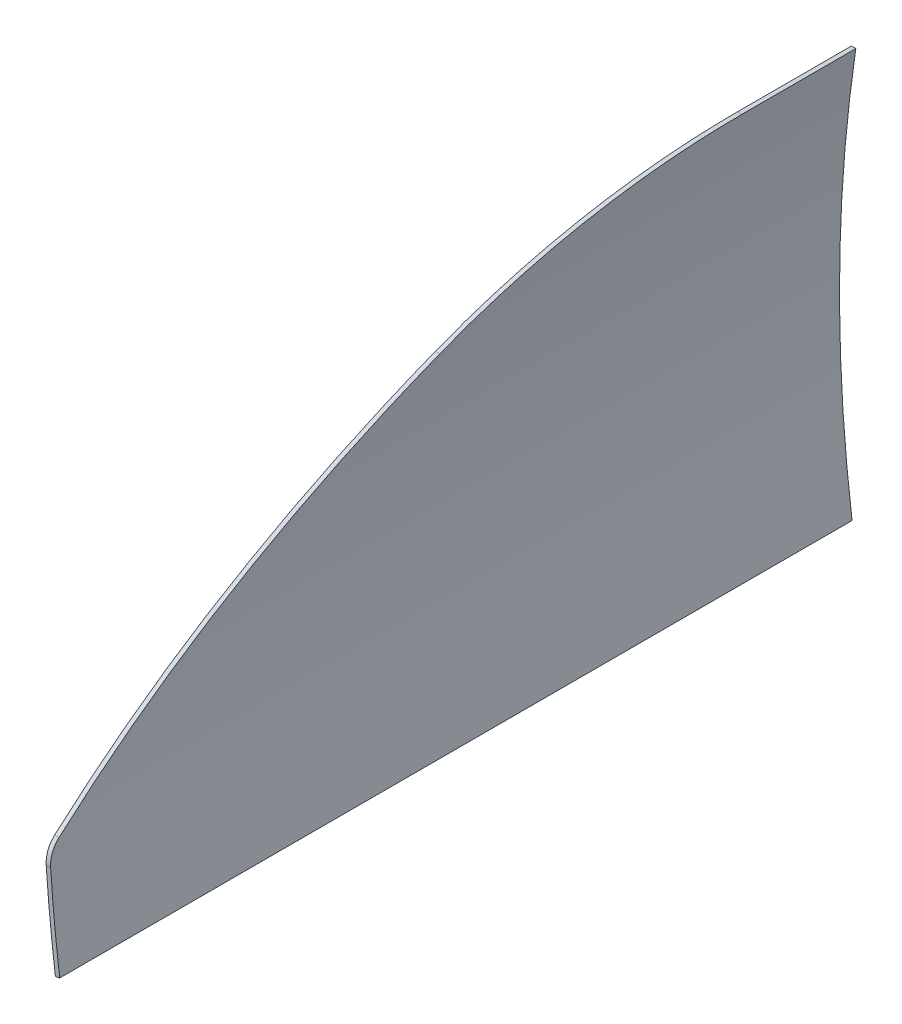
ISO-10303-21;
HEADER;
FILE_DESCRIPTION(('STEP AP214'),'2;1');
FILE_NAME('part.step','',(''),(''),'','','');
FILE_SCHEMA(('AUTOMOTIVE_DESIGN { 1 0 10303 214 1 1 1 1 }'));
ENDSEC;
DATA;
#1=APPLICATION_CONTEXT('core data for automotive mechanical design processes');
#2=APPLICATION_PROTOCOL_DEFINITION('international standard','automotive_design',2000,#1);
#3=PRODUCT_CONTEXT('',#1,'mechanical');
#4=PRODUCT('Part','Part','',(#3));
#5=PRODUCT_RELATED_PRODUCT_CATEGORY('part','',(#4));
#6=PRODUCT_DEFINITION_FORMATION('','',#4);
#7=PRODUCT_DEFINITION_CONTEXT('part definition',#1,'design');
#8=PRODUCT_DEFINITION('design','',#6,#7);
#9=PRODUCT_DEFINITION_SHAPE('','',#8);
#10=(LENGTH_UNIT() NAMED_UNIT(*) SI_UNIT(.MILLI.,.METRE.));
#11=(NAMED_UNIT(*) PLANE_ANGLE_UNIT() SI_UNIT($,.RADIAN.));
#12=(NAMED_UNIT(*) SI_UNIT($,.STERADIAN.) SOLID_ANGLE_UNIT());
#13=UNCERTAINTY_MEASURE_WITH_UNIT(LENGTH_MEASURE(1.E-05),#10,'distance_accuracy_value','');
#14=(GEOMETRIC_REPRESENTATION_CONTEXT(3) GLOBAL_UNCERTAINTY_ASSIGNED_CONTEXT((#13)) GLOBAL_UNIT_ASSIGNED_CONTEXT((#10,
#11,#12)) REPRESENTATION_CONTEXT('',''));
#15=CARTESIAN_POINT('',(0.,0.,0.));
#16=DIRECTION('',(0.,0.,1.));
#17=DIRECTION('',(1.,0.,0.));
#18=AXIS2_PLACEMENT_3D('',#15,#16,#17);
#19=CARTESIAN_POINT('',(1662.91267359414,250.,500.));
#20=DIRECTION('',(0.,0.,-1.));
#21=DIRECTION('',(-1.,0.,0.));
#22=AXIS2_PLACEMENT_3D('',#19,#20,#21);
#23=CYLINDRICAL_SURFACE('',#22,1679.1);
#24=CARTESIAN_POINT('',(1662.91267359414,250.,404.));
#25=DIRECTION('',(0.,0.,1.));
#26=DIRECTION('',(1.,0.,0.));
#27=AXIS2_PLACEMENT_3D('',#24,#25,#26);
#28=CIRCLE('',#27,1679.1);
#29=CARTESIAN_POINT('',(-1.85821629717053,31.1057466023691,404.));
#30=VERTEX_POINT('',#29);
#31=CARTESIAN_POINT('',(-12.2574940213667,135.188330161751,404.));
#32=VERTEX_POINT('',#31);
#33=EDGE_CURVE('E74',#30,#32,#28,.F.);
#34=ORIENTED_EDGE('',*,*,#33,.F.);
#35=DIRECTION('',(0.,0.,1.));
#36=VECTOR('',#35,1.);
#37=CARTESIAN_POINT('',(-1.85821629717053,31.1057466023691,-500.));
#38=LINE('',#37,#36);
#39=CARTESIAN_POINT('',(-1.85821629717053,31.1057466023691,-500.));
#40=VERTEX_POINT('',#39);
#41=EDGE_CURVE('E115',#40,#30,#38,.T.);
#42=ORIENTED_EDGE('',*,*,#41,.F.);
#43=CARTESIAN_POINT('',(1662.91267359414,250.,-500.));
#44=DIRECTION('',(0.,0.,1.));
#45=DIRECTION('',(1.,0.,0.));
#46=AXIS2_PLACEMENT_3D('',#43,#44,#45);
#47=CIRCLE('',#46,1679.1);
#48=CARTESIAN_POINT('',(2.4722179376695,499.628330161751,-500.));
#49=VERTEX_POINT('',#48);
#50=EDGE_CURVE('E66',#40,#49,#47,.F.);
#51=ORIENTED_EDGE('',*,*,#50,.T.);
#52=DIRECTION('',(0.,0.,1.));
#53=VECTOR('',#52,1.);
#54=CARTESIAN_POINT('',(2.4722179376695,499.628330161751,500.));
#55=LINE('',#54,#53);
#56=CARTESIAN_POINT('',(2.4722179376695,499.628330161751,-370.));
#57=VERTEX_POINT('',#56);
#58=EDGE_CURVE('E208',#49,#57,#55,.T.);
#59=ORIENTED_EDGE('',*,*,#58,.T.);
#60=CARTESIAN_POINT('',(-6.9458065284167,425.92460419963,-34.5991617203481));
#61=CARTESIAN_POINT('',(-6.69665422505623,428.289455799148,-39.7201293279682));
#62=CARTESIAN_POINT('',(-6.44814509912683,430.600140181221,-44.8661296534168));
#63=CARTESIAN_POINT('',(-5.95383995624069,435.112203418949,-55.2059611368377));
#64=CARTESIAN_POINT('',(-5.70804394052839,437.313582224469,-60.3997923167466));
#65=CARTESIAN_POINT('',(-5.22058710120033,441.606104214611,-70.8331511283629));
#66=CARTESIAN_POINT('',(-4.97892636085668,443.697245181133,-76.0726796770793));
#67=CARTESIAN_POINT('',(-4.5011069586019,447.768281725359,-86.5949217074381));
#68=CARTESIAN_POINT('',(-4.26494829526287,449.748177331933,-91.8776351778729));
#69=CARTESIAN_POINT('',(-3.56643098544166,455.521918043394,-107.793379311696));
#70=CARTESIAN_POINT('',(-3.11429256666275,459.147536755344,-118.488471315989));
#71=CARTESIAN_POINT('',(-2.24712198400071,465.943039964759,-140.023356894242));
#72=CARTESIAN_POINT('',(-1.83208912227906,469.112933033668,-150.863147742464));
#73=CARTESIAN_POINT('',(-1.0548726973034,474.938422892343,-172.47225093206));
#74=CARTESIAN_POINT('',(-0.691871298106507,477.602260730111,-183.239311186875));
#75=CARTESIAN_POINT('',(-0.0171953739844435,482.480376850164,-204.876803532081));
#76=CARTESIAN_POINT('',(0.294477429150202,484.694640052288,-215.74723907721));
#77=CARTESIAN_POINT('',(0.860236924533955,488.668247349398,-237.565499413399));
#78=CARTESIAN_POINT('',(1.11435833954759,490.427865838209,-248.513273409471));
#79=CARTESIAN_POINT('',(1.56034320955563,493.490542973513,-270.472829099929));
#80=CARTESIAN_POINT('',(1.75221486004451,494.793661722294,-281.484602174044));
#81=CARTESIAN_POINT('',(1.95738850827555,496.179701213508,-295.728081119642));
#82=CARTESIAN_POINT('',(2.00083869214886,496.472639202832,-298.939820124848));
#83=CARTESIAN_POINT('',(2.08210450724497,497.019652066328,-305.366580087286));
#84=CARTESIAN_POINT('',(2.11992035367996,497.273728424889,-308.581600914437));
#85=CARTESIAN_POINT('',(2.22481135626323,497.977538930866,-318.230025533762));
#86=CARTESIAN_POINT('',(2.2833455097172,498.368959189604,-324.667867252615));
#87=CARTESIAN_POINT('',(2.37749551935759,498.997669252438,-337.585551031748));
#88=CARTESIAN_POINT('',(2.41298766087124,499.234127112253,-344.065434177928));
#89=CARTESIAN_POINT('',(2.46036435475485,499.549479026968,-357.030200862375));
#90=CARTESIAN_POINT('',(2.47224496859774,499.628346795023,-363.515085054397));
#91=CARTESIAN_POINT('',(2.4722179376695,499.628330161751,-370.));
#92=B_SPLINE_CURVE_WITH_KNOTS('',3,(#60,#61,#62,#63,#64,#65,#66,#67,#68,#69,#70,#71,#72,#73,#74,
#75,#76,#77,#78,#79,#80,#81,#82,#83,#84,#85,#86,#87,#88,#89,#90,#91),.UNSPECIFIED.,.F.,.F.,(4,2,
2,2,2,2,2,2,2,2,2,2,2,2,2,4),(0.,16.9380846326702,33.8761770340212,50.8146101176378,
67.7530388053932,101.647878235621,135.542080076646,168.82527471867,202.109585600496,
235.373761075662,268.63355537605,278.309500796286,287.985076534121,307.332985956469,
326.783935297484,346.238128886989),.UNSPECIFIED.);
#93=CARTESIAN_POINT('',(-6.9458065284167,425.92460419963,-34.5991617203481));
#94=VERTEX_POINT('',#93);
#95=EDGE_CURVE('E199',#94,#57,#92,.T.);
#96=ORIENTED_EDGE('',*,*,#95,.F.);
#97=CARTESIAN_POINT('',(-13.6875775153225,158.411747589012,392.991389706895));
#98=CARTESIAN_POINT('',(-14.0526604980433,165.095014728516,384.818851780009));
#99=CARTESIAN_POINT('',(-14.3741894513233,171.714468700817,376.592252404173));
#100=CARTESIAN_POINT('',(-14.9347228152785,184.82354667566,360.033583620257));
#101=CARTESIAN_POINT('',(-15.1737279246748,191.313171777011,351.701515105794));
#102=CARTESIAN_POINT('',(-15.5737914896637,204.160127369066,334.934910867642));
#103=CARTESIAN_POINT('',(-15.7348544857563,210.51746554546,326.500381142157));
#104=CARTESIAN_POINT('',(-15.9835965028871,223.098173918881,309.531048813833));
#105=CARTESIAN_POINT('',(-16.0712753699186,229.321543834731,300.996246000595));
#106=CARTESIAN_POINT('',(-16.2305403339362,247.734216196206,275.319992747535));
#107=CARTESIAN_POINT('',(-16.2000296183187,259.722524737032,258.033022289067));
#108=CARTESIAN_POINT('',(-15.9009872164411,283.146739309586,223.091173373515));
#109=CARTESIAN_POINT('',(-15.6324524413265,294.582638170626,205.436290144906));
#110=CARTESIAN_POINT('',(-14.8915988909184,316.889129816982,169.7791494636));
#111=CARTESIAN_POINT('',(-14.4192959396728,327.759766425494,151.776919088559));
#112=CARTESIAN_POINT('',(-13.3041349428485,348.925923713831,115.442257232489));
#113=CARTESIAN_POINT('',(-12.6612763550171,359.221442565041,97.1098247018112));
#114=CARTESIAN_POINT('',(-11.5916576630007,374.247366502559,69.3379216376989));
#115=CARTESIAN_POINT('',(-11.2166229949857,379.196852325935,60.0143072319904));
#116=CARTESIAN_POINT('',(-10.4355944865959,388.947127714602,41.2908091601246));
#117=CARTESIAN_POINT('',(-10.02960061899,393.747917149098,31.8909254268886));
#118=CARTESIAN_POINT('',(-9.19056339639171,403.199499034462,13.0175340798333));
#119=CARTESIAN_POINT('',(-8.7575206256569,407.850294721914,3.54402806012586));
#120=CARTESIAN_POINT('',(-7.86816742590298,417.000928185204,-15.474496926653));
#121=CARTESIAN_POINT('',(-7.4118570623023,421.500766385411,-25.0195156925972));
#122=CARTESIAN_POINT('',(-6.94580652841649,425.92460419963,-34.5991617203481));
#123=B_SPLINE_CURVE_WITH_KNOTS('',3,(#97,#98,#99,#100,#101,#102,#103,#104,#105,#106,#107,#108,
#109,#110,#111,#112,#113,#114,#115,#116,#117,#118,#119,#120,#121,#122),.UNSPECIFIED.,.F.,.F.,(4,
2,2,2,2,2,2,2,2,2,2,2,4),(0.,31.6903050230312,63.3803417208028,95.0685321004802,
126.756788982061,189.854971713458,252.953973286261,316.048075654653,379.142378622431,
410.828963890059,442.515577028968,474.201505972228,505.887345833241),.UNSPECIFIED.);
#124=CARTESIAN_POINT('',(-13.6875775153225,158.411747589012,392.991389706895));
#125=VERTEX_POINT('',#124);
#126=EDGE_CURVE('E177',#125,#94,#123,.T.);
#127=ORIENTED_EDGE('',*,*,#126,.F.);
#128=CARTESIAN_POINT('',(-12.2574940213667,135.188330161751,404.));
#129=CARTESIAN_POINT('',(-12.2864303509859,135.610524856966,404.000000461225));
#130=CARTESIAN_POINT('',(-12.3152033484983,136.032683792228,403.991086522892));
#131=CARTESIAN_POINT('',(-12.3723795026291,136.876264779503,403.955452294848));
#132=CARTESIAN_POINT('',(-12.4007826677193,137.297686848203,403.928732413751));
#133=CARTESIAN_POINT('',(-12.4853616680688,138.559685367766,403.821913287983));
#134=CARTESIAN_POINT('',(-12.5409203534523,139.398188875581,403.71515453871));
#135=CARTESIAN_POINT('',(-12.6499925060041,141.063056240984,403.431283643352));
#136=CARTESIAN_POINT('',(-12.7035066300835,141.88942394433,403.254194306229));
#137=CARTESIAN_POINT('',(-12.7820081314885,143.115428253876,402.936818231514));
#138=CARTESIAN_POINT('',(-12.8078810880648,143.521850268377,402.822398391185));
#139=CARTESIAN_POINT('',(-12.8590142278855,144.329644118176,402.576470713362));
#140=CARTESIAN_POINT('',(-12.8842742524691,144.731014633194,402.44495850625));
#141=CARTESIAN_POINT('',(-12.9591045688719,145.926800879809,402.024973246489));
#142=CARTESIAN_POINT('',(-13.0077016081075,146.712524044109,401.711146657477));
#143=CARTESIAN_POINT('',(-13.1020404921137,148.254802470497,401.018179450907));
#144=CARTESIAN_POINT('',(-13.1477823222455,149.011357583031,400.639038498518));
#145=CARTESIAN_POINT('',(-13.214080157634,150.119809342587,400.023633414351));
#146=CARTESIAN_POINT('',(-13.2357877410823,150.484795843403,399.810783643453));
#147=CARTESIAN_POINT('',(-13.278414448833,151.205381719959,399.369912307869));
#148=CARTESIAN_POINT('',(-13.2993337916973,151.560983689508,399.141894998031));
#149=CARTESIAN_POINT('',(-13.3608843173413,152.61282487253,398.43562509339));
#150=CARTESIAN_POINT('',(-13.4003237306304,153.294362851921,397.935008205251));
#151=CARTESIAN_POINT('',(-13.4615129469372,154.362325531576,397.07884015903));
#152=CARTESIAN_POINT('',(-13.4842945370347,154.762566032009,396.740361341184));
#153=CARTESIAN_POINT('',(-13.5285512291079,155.544809266365,396.042872146603));
#154=CARTESIAN_POINT('',(-13.5500264614183,155.926813818856,395.683863825042));
#155=CARTESIAN_POINT('',(-13.5916281455417,156.671145444289,394.946664158291));
#156=CARTESIAN_POINT('',(-13.6117559204717,157.033491752044,394.568492291312));
#157=CARTESIAN_POINT('',(-13.6506747354486,157.738016724901,393.793587158713));
#158=CARTESIAN_POINT('',(-13.6694654753302,158.080190858401,393.396849758054));
#159=CARTESIAN_POINT('',(-13.6875775153225,158.411747589012,392.991389706895));
#160=B_SPLINE_CURVE_WITH_KNOTS('',3,(#128,#129,#130,#131,#132,#133,#134,#135,#136,#137,#138,
#139,#140,#141,#142,#143,#144,#145,#146,#147,#148,#149,#150,#151,#152,#153,#154,#155,#156,#157,
#158,#159),.UNSPECIFIED.,.F.,.F.,(4,2,2,2,2,2,2,2,2,2,2,2,2,2,2,4),(0.,1.26936796567069,
2.53870680251005,5.07680077410025,7.61407228599208,8.88278287242372,10.1518184415712,
12.6910262003151,15.2302469765906,16.4991318934746,17.7676623476523,20.3038206508079,
21.8772282234229,23.4504785596797,25.0221606911959,26.5941945601457),.UNSPECIFIED.);
#161=EDGE_CURVE('E136',#32,#125,#160,.T.);
#162=ORIENTED_EDGE('',*,*,#161,.F.);
#163=EDGE_LOOP('',(#34,#42,#51,#59,#96,#127,#162));
#164=FACE_BOUND('',#163,.T.);
#165=ADVANCED_FACE('F48',(#164),#23,.F.);
#166=CARTESIAN_POINT('',(1662.91267359414,250.,500.));
#167=DIRECTION('',(0.,0.,-1.));
#168=DIRECTION('',(-1.,0.,0.));
#169=AXIS2_PLACEMENT_3D('',#166,#167,#168);
#170=CYLINDRICAL_SURFACE('',#169,1684.1);
#171=CARTESIAN_POINT('',(1662.91267359414,250.,-500.));
#172=DIRECTION('',(0.,0.,1.));
#173=DIRECTION('',(1.,0.,0.));
#174=AXIS2_PLACEMENT_3D('',#171,#172,#173);
#175=CIRCLE('',#174,1684.1);
#176=CARTESIAN_POINT('',(-6.7806035687441,30.1883301617507,-500.));
#177=VERTEX_POINT('',#176);
#178=CARTESIAN_POINT('',(-2.58380096852528,499.628330161751,-500.));
#179=VERTEX_POINT('',#178);
#180=EDGE_CURVE('E132',#177,#179,#175,.F.);
#181=ORIENTED_EDGE('',*,*,#180,.F.);
#182=DIRECTION('',(0.,0.,-1.));
#183=VECTOR('',#182,1.);
#184=CARTESIAN_POINT('',(-6.7806035687441,30.1883301617507,500.));
#185=LINE('',#184,#183);
#186=CARTESIAN_POINT('',(-6.7806035687441,30.1883301617507,404.));
#187=VERTEX_POINT('',#186);
#188=EDGE_CURVE('E117',#177,#187,#185,.F.);
#189=ORIENTED_EDGE('',*,*,#188,.T.);
#190=CARTESIAN_POINT('',(1662.91267359414,250.,404.));
#191=DIRECTION('',(0.,0.,1.));
#192=DIRECTION('',(1.,0.,0.));
#193=AXIS2_PLACEMENT_3D('',#190,#191,#192);
#194=CIRCLE('',#193,1684.1);
#195=CARTESIAN_POINT('',(-17.2691887258185,135.188330161751,404.));
#196=VERTEX_POINT('',#195);
#197=EDGE_CURVE('E12',#187,#196,#194,.F.);
#198=ORIENTED_EDGE('',*,*,#197,.T.);
#199=CARTESIAN_POINT('',(-17.2691887258185,135.188330161751,404.));
#200=CARTESIAN_POINT('',(-17.2980386030764,135.610522804638,404.000000461543));
#201=CARTESIAN_POINT('',(-17.326725636894,136.03267962108,403.991086609519));
#202=CARTESIAN_POINT('',(-17.3837309692695,136.876256231334,403.955452745514));
#203=CARTESIAN_POINT('',(-17.4120492762758,137.29767604184,403.928733142238));
#204=CARTESIAN_POINT('',(-17.4963755833221,138.559667528155,403.821915170074));
#205=CARTESIAN_POINT('',(-17.5517682778365,139.398166049207,403.715157616705));
#206=CARTESIAN_POINT('',(-17.6605145245861,141.063022378518,403.431290230891));
#207=CARTESIAN_POINT('',(-17.7138687330068,141.889384039979,403.254203250137));
#208=CARTESIAN_POINT('',(-17.7921356511594,143.115378964162,402.936831684554));
#209=CARTESIAN_POINT('',(-17.8179312930374,143.521797799806,402.822413508549));
#210=CARTESIAN_POINT('',(-17.8689116354754,144.329585197265,402.576489507919));
#211=CARTESIAN_POINT('',(-17.8940961778524,144.730952438805,402.444979313855));
#212=CARTESIAN_POINT('',(-17.9687028733519,145.926728516122,402.025000734499));
#213=CARTESIAN_POINT('',(-18.0171546853825,146.712444682599,401.711179389619));
#214=CARTESIAN_POINT('',(-18.1112116625723,148.254709070757,401.018224342528));
#215=CARTESIAN_POINT('',(-18.156816813109,149.011257142603,400.639090304863));
#216=CARTESIAN_POINT('',(-18.2229165717523,150.119698636821,400.02369685552));
#217=CARTESIAN_POINT('',(-18.244559307479,150.484681820997,399.810851135133));
#218=CARTESIAN_POINT('',(-18.2870586826039,151.205261155659,399.369988340947));
#219=CARTESIAN_POINT('',(-18.3079155399107,151.560859899949,399.141975521905));
#220=CARTESIAN_POINT('',(-18.3692822301283,152.612691620429,398.435719750554));
#221=CARTESIAN_POINT('',(-18.4086038662512,153.294223547496,397.93511318287));
#222=CARTESIAN_POINT('',(-18.4696114301195,154.362195266067,397.078948750587));
#223=CARTESIAN_POINT('',(-18.4923259913739,154.762449818049,396.740461739253));
#224=CARTESIAN_POINT('',(-18.5364524316384,155.544719903156,396.042955049399));
#225=CARTESIAN_POINT('',(-18.557864440595,155.926737254858,395.683937426031));
#226=CARTESIAN_POINT('',(-18.5993436052089,156.671093090346,394.946718237319));
#227=CARTESIAN_POINT('',(-18.6194120803722,157.033450813814,394.568536154789));
#228=CARTESIAN_POINT('',(-18.658216192609,157.737997273491,393.793609718593));
#229=CARTESIAN_POINT('',(-18.6769515304192,158.080181478202,393.39686123006));
#230=CARTESIAN_POINT('',(-18.695010147913,158.411747589012,392.991389706895));
#231=B_SPLINE_CURVE_WITH_KNOTS('',3,(#199,#200,#201,#202,#203,#204,#205,#206,#207,#208,#209,
#210,#211,#212,#213,#214,#215,#216,#217,#218,#219,#220,#221,#222,#223,#224,#225,#226,#227,#228,
#229,#230),.UNSPECIFIED.,.F.,.F.,(4,2,2,2,2,2,2,2,2,2,2,2,2,2,2,4),(0.,1.2693441151616,
2.53865909538994,5.07670522118877,7.61392734975939,8.88261326498726,10.1516241498798,
12.6907817628197,15.2299524175547,16.4988126838984,17.7673184917157,20.3034276082294,
21.8768744158896,23.4501639934887,25.0218850363801,26.5939577940011),.UNSPECIFIED.);
#232=CARTESIAN_POINT('',(-18.6950101479129,158.411747589012,392.991389706895));
#233=VERTEX_POINT('',#232);
#234=EDGE_CURVE('E58',#196,#233,#231,.T.);
#235=ORIENTED_EDGE('',*,*,#234,.T.);
#236=CARTESIAN_POINT('',(-18.6950101479129,158.411747589012,392.991389706895));
#237=CARTESIAN_POINT('',(-19.0590059421974,165.095013310755,384.818853435521));
#238=CARTESIAN_POINT('',(-19.3795777885102,171.714460443679,376.5922625533));
#239=CARTESIAN_POINT('',(-19.9384431717419,184.823517383443,360.033620901376));
#240=CARTESIAN_POINT('',(-20.1767374010784,191.313128282502,351.701571019787));
#241=CARTESIAN_POINT('',(-20.5756115570721,204.160053083755,334.935008668439));
#242=CARTESIAN_POINT('',(-20.7361959844722,210.517374627379,326.500502161703));
#243=CARTESIAN_POINT('',(-20.9841993254012,223.09804747527,309.531220979981));
#244=CARTESIAN_POINT('',(-21.0716180863699,229.321398500165,300.99644609596));
#245=CARTESIAN_POINT('',(-21.2304117043605,247.734041780501,275.320241088689));
#246=CARTESIAN_POINT('',(-21.199992881682,259.722338347722,258.033293755944));
#247=CARTESIAN_POINT('',(-20.9018413949271,283.146535568569,223.091483863613));
#248=CARTESIAN_POINT('',(-20.6341056706867,294.582429097039,205.436616562623));
#249=CARTESIAN_POINT('',(-19.8954566431234,316.888927216849,169.779481109527));
#250=CARTESIAN_POINT('',(-19.4245590235788,327.759575371669,151.777239876601));
#251=CARTESIAN_POINT('',(-18.3127183665835,348.925767934325,115.442531831892));
#252=CARTESIAN_POINT('',(-17.6717747907739,359.221310521274,97.110063974797));
#253=CARTESIAN_POINT('',(-16.6053464220672,374.247266325702,69.3381091914475));
#254=CARTESIAN_POINT('',(-16.231431467058,379.196756675552,60.0144886901535));
#255=CARTESIAN_POINT('',(-15.4527361752718,388.947043965024,41.2909722043681));
#256=CARTESIAN_POINT('',(-15.0479558114803,393.7478407745,31.8910761531243));
#257=CARTESIAN_POINT('',(-14.2114279958425,403.199440475927,13.01765279477));
#258=CARTESIAN_POINT('',(-13.7796811228182,407.850246584103,3.54412707190072));
#259=CARTESIAN_POINT('',(-12.8929911857361,417.000902821171,-15.4744431733763));
#260=CARTESIAN_POINT('',(-12.4380481865187,421.500753371973,-25.0194874958036));
#261=CARTESIAN_POINT('',(-11.9733952586683,425.92460419963,-34.5991617203483));
#262=B_SPLINE_CURVE_WITH_KNOTS('',3,(#236,#237,#238,#239,#240,#241,#242,#243,#244,#245,#246,
#247,#248,#249,#250,#251,#252,#253,#254,#255,#256,#257,#258,#259,#260,#261),.UNSPECIFIED.,.F.,
.F.,(4,2,2,2,2,2,2,2,2,2,2,2,4),(0.,31.690186833034,63.3801069668416,95.0681914859438,
126.75634207878,189.854457238723,252.953386050714,316.047444596156,379.141702897296,
410.828191784113,442.514708404305,474.200545123689,505.886293276134),.UNSPECIFIED.);
#263=CARTESIAN_POINT('',(-11.9733952586685,425.92460419963,-34.5991617203481));
#264=VERTEX_POINT('',#263);
#265=EDGE_CURVE('E149',#233,#264,#262,.T.);
#266=ORIENTED_EDGE('',*,*,#265,.T.);
#267=CARTESIAN_POINT('',(-11.9733952586685,425.92460419963,-34.5991617203481));
#268=CARTESIAN_POINT('',(-11.7249826032305,428.289534261498,-39.7202992192848));
#269=CARTESIAN_POINT('',(-11.477211584378,430.600293434025,-44.866470957045));
#270=CARTESIAN_POINT('',(-10.9843754167438,435.112498708392,-55.2066477114232));
#271=CARTESIAN_POINT('',(-10.7393102691941,437.313944760463,-60.4006527498185));
#272=CARTESIAN_POINT('',(-10.2533037923008,441.606593427659,-70.8343609519812));
#273=CARTESIAN_POINT('',(-10.01236254583,443.69779382907,-76.0740650309177));
#274=CARTESIAN_POINT('',(-9.53596673581244,447.768941388827,-86.5966594393715));
#275=CARTESIAN_POINT('',(-9.30051217084658,449.74888857595,-91.8795497577177));
#276=CARTESIAN_POINT('',(-8.60407922721631,455.522770683743,-107.795821771126));
#277=CARTESIAN_POINT('',(-8.15329218105951,459.148467444129,-118.491265955587));
#278=CARTESIAN_POINT('',(-7.2887179889605,465.944095008922,-140.026855078916));
#279=CARTESIAN_POINT('',(-6.87493014761872,469.114034379964,-150.866997293785));
#280=CARTESIAN_POINT('',(-6.10004964455078,474.939587826747,-172.476803767954));
#281=CARTESIAN_POINT('',(-5.73814155831987,477.603443058794,-183.24421613666));
#282=CARTESIAN_POINT('',(-5.06550272324403,482.481563524898,-204.882406764811));
#283=CARTESIAN_POINT('',(-4.75477369104536,484.695813678895,-215.753188478539));
#284=CARTESIAN_POINT('',(-4.19073286068251,488.669365699768,-237.572134795353));
#285=CARTESIAN_POINT('',(-3.93738644800712,490.428941927094,-248.520248617387));
#286=CARTESIAN_POINT('',(-3.49276810966322,493.491506162567,-270.480475935082));
#287=CARTESIAN_POINT('',(-3.30148801279038,494.794554275722,-281.492580811673));
#288=CARTESIAN_POINT('',(-3.09695841018485,496.180442680612,-295.736048574116));
#289=CARTESIAN_POINT('',(-3.05364919660776,496.473317983097,-298.947447772117));
#290=CARTESIAN_POINT('',(-2.97264709858215,497.020213703438,-305.37352663182));
#291=CARTESIAN_POINT('',(-2.9349539996391,497.27423560522,-308.588206163515));
#292=CARTESIAN_POINT('',(-2.83040353097441,497.977895146691,-318.235604937802));
#293=CARTESIAN_POINT('',(-2.77205950474492,498.369231288201,-324.672760107366));
#294=CARTESIAN_POINT('',(-2.67821542833253,498.99780573721,-337.589057219576));
#295=CARTESIAN_POINT('',(-2.6428386682791,499.234212433979,-344.068240221767));
#296=CARTESIAN_POINT('',(-2.59561600897564,499.549496096687,-357.031604802297));
#297=CARTESIAN_POINT('',(-2.58377403579578,499.628346779162,-363.515787034148));
#298=CARTESIAN_POINT('',(-2.58380096852547,499.628330161751,-370.));
#299=B_SPLINE_CURVE_WITH_KNOTS('',3,(#267,#268,#269,#270,#271,#272,#273,#274,#275,#276,#277,
#278,#279,#280,#281,#282,#283,#284,#285,#286,#287,#288,#289,#290,#291,#292,#293,#294,#295,#296,
#297,#298),.UNSPECIFIED.,.F.,.F.,(4,2,2,2,2,2,2,2,2,2,2,2,2,2,2,4),(0.,16.9385476788605,
33.8771030698093,50.8159984547608,67.7548894582471,101.650641035824,135.545755409213,
168.82988000149,202.1151207816,235.380229348293,268.640956691687,278.315864314328,
287.990402331422,307.336236441075,326.785080171984,346.237168084292),.UNSPECIFIED.);
#300=CARTESIAN_POINT('',(-2.58380096852528,499.628330161751,-370.));
#301=VERTEX_POINT('',#300);
#302=EDGE_CURVE('E185',#264,#301,#299,.T.);
#303=ORIENTED_EDGE('',*,*,#302,.T.);
#304=DIRECTION('',(0.,0.,-1.));
#305=VECTOR('',#304,1.);
#306=CARTESIAN_POINT('',(-2.58380096852528,499.628330161751,500.));
#307=LINE('',#306,#305);
#308=EDGE_CURVE('E211',#301,#179,#307,.T.);
#309=ORIENTED_EDGE('',*,*,#308,.T.);
#310=EDGE_LOOP('',(#181,#189,#198,#235,#266,#303,#309));
#311=FACE_BOUND('',#310,.T.);
#312=ADVANCED_FACE('F156',(#311),#170,.T.);
#313=CARTESIAN_POINT('',(1662.91267359414,250.,-500.));
#314=DIRECTION('',(0.,0.,1.));
#315=DIRECTION('',(1.,0.,0.));
#316=AXIS2_PLACEMENT_3D('',#313,#314,#315);
#317=PLANE('',#316);
#318=ORIENTED_EDGE('',*,*,#50,.F.);
#319=DIRECTION('',(-0.983071696061995,-0.183221288069353,0.));
#320=VECTOR('',#319,1.);
#321=CARTESIAN_POINT('',(-6.7806035687441,30.1883301617507,-500.));
#322=LINE('',#321,#320);
#323=EDGE_CURVE('E113',#40,#177,#322,.T.);
#324=ORIENTED_EDGE('',*,*,#323,.T.);
#325=ORIENTED_EDGE('',*,*,#180,.T.);
#326=DIRECTION('',(-1.,0.,0.));
#327=VECTOR('',#326,1.);
#328=CARTESIAN_POINT('',(1662.91267359414,499.628330161751,-500.));
#329=LINE('',#328,#327);
#330=EDGE_CURVE('E130',#49,#179,#329,.T.);
#331=ORIENTED_EDGE('',*,*,#330,.F.);
#332=EDGE_LOOP('',(#318,#324,#325,#331));
#333=FACE_BOUND('',#332,.T.);
#334=ADVANCED_FACE('F129',(#333),#317,.F.);
#335=CARTESIAN_POINT('',(-40.,30.1883301617507,404.));
#336=DIRECTION('',(0.,0.,1.));
#337=DIRECTION('',(1.,0.,0.));
#338=AXIS2_PLACEMENT_3D('',#335,#336,#337);
#339=PLANE('',#338);
#340=DIRECTION('',(-0.983071696061995,-0.183221288069353,0.));
#341=VECTOR('',#340,1.);
#342=CARTESIAN_POINT('',(-6.7806035687441,30.1883301617507,404.));
#343=LINE('',#342,#341);
#344=EDGE_CURVE('E122',#30,#187,#343,.T.);
#345=ORIENTED_EDGE('',*,*,#344,.F.);
#346=ORIENTED_EDGE('',*,*,#33,.T.);
#347=DIRECTION('',(1.,0.,0.));
#348=VECTOR('',#347,1.);
#349=CARTESIAN_POINT('',(-40.,135.188330161751,404.));
#350=LINE('',#349,#348);
#351=EDGE_CURVE('E215',#196,#32,#350,.T.);
#352=ORIENTED_EDGE('',*,*,#351,.F.);
#353=ORIENTED_EDGE('',*,*,#197,.F.);
#354=EDGE_LOOP('',(#345,#346,#352,#353));
#355=FACE_BOUND('',#354,.T.);
#356=ADVANCED_FACE('F164',(#355),#339,.T.);
#357=CARTESIAN_POINT('',(-40.,135.188330161751,374.));
#358=DIRECTION('',(1.,0.,0.));
#359=DIRECTION('',(0.,0.,-1.));
#360=AXIS2_PLACEMENT_3D('',#357,#358,#359);
#361=CYLINDRICAL_SURFACE('',#360,29.9999999999999);
#362=ORIENTED_EDGE('',*,*,#161,.T.);
#363=DIRECTION('',(1.,0.,0.));
#364=VECTOR('',#363,1.);
#365=CARTESIAN_POINT('',(-40.,158.411747589012,392.991389706895));
#366=LINE('',#365,#364);
#367=EDGE_CURVE('E223',#233,#125,#366,.T.);
#368=ORIENTED_EDGE('',*,*,#367,.F.);
#369=ORIENTED_EDGE('',*,*,#234,.F.);
#370=ORIENTED_EDGE('',*,*,#351,.T.);
#371=EDGE_LOOP('',(#362,#368,#369,#370));
#372=FACE_BOUND('',#371,.T.);
#373=ADVANCED_FACE('F159',(#372),#361,.T.);
#374=CARTESIAN_POINT('',(-40.,-1389.81608089507,-873.101257419478));
#375=DIRECTION('',(1.,0.,0.));
#376=DIRECTION('',(0.,0.,-1.));
#377=AXIS2_PLACEMENT_3D('',#374,#375,#376);
#378=CYLINDRICAL_SURFACE('',#377,2000.);
#379=ORIENTED_EDGE('',*,*,#126,.T.);
#380=DIRECTION('',(1.,0.,0.));
#381=VECTOR('',#380,1.);
#382=CARTESIAN_POINT('',(-40.,425.92460419963,-34.5991617203481));
#383=LINE('',#382,#381);
#384=EDGE_CURVE('E219',#264,#94,#383,.T.);
#385=ORIENTED_EDGE('',*,*,#384,.F.);
#386=ORIENTED_EDGE('',*,*,#265,.F.);
#387=ORIENTED_EDGE('',*,*,#367,.T.);
#388=EDGE_LOOP('',(#379,#385,#386,#387));
#389=FACE_BOUND('',#388,.T.);
#390=ADVANCED_FACE('F163',(#389),#378,.T.);
#391=CARTESIAN_POINT('',(-40.,-300.371669838249,-370.));
#392=DIRECTION('',(1.,0.,0.));
#393=DIRECTION('',(0.,0.,-1.));
#394=AXIS2_PLACEMENT_3D('',#391,#392,#393);
#395=CYLINDRICAL_SURFACE('',#394,800.);
#396=ORIENTED_EDGE('',*,*,#95,.T.);
#397=DIRECTION('',(1.,0.,0.));
#398=VECTOR('',#397,1.);
#399=CARTESIAN_POINT('',(-40.,499.628330161751,-370.));
#400=LINE('',#399,#398);
#401=EDGE_CURVE('E126',#301,#57,#400,.T.);
#402=ORIENTED_EDGE('',*,*,#401,.F.);
#403=ORIENTED_EDGE('',*,*,#302,.F.);
#404=ORIENTED_EDGE('',*,*,#384,.T.);
#405=EDGE_LOOP('',(#396,#402,#403,#404));
#406=FACE_BOUND('',#405,.T.);
#407=ADVANCED_FACE('F192',(#406),#395,.T.);
#408=CARTESIAN_POINT('',(-40.,499.628330161751,-500.));
#409=DIRECTION('',(0.,1.,0.));
#410=DIRECTION('',(0.,0.,1.));
#411=AXIS2_PLACEMENT_3D('',#408,#409,#410);
#412=PLANE('',#411);
#413=ORIENTED_EDGE('',*,*,#330,.T.);
#414=ORIENTED_EDGE('',*,*,#308,.F.);
#415=ORIENTED_EDGE('',*,*,#401,.T.);
#416=ORIENTED_EDGE('',*,*,#58,.F.);
#417=EDGE_LOOP('',(#413,#414,#415,#416));
#418=FACE_BOUND('',#417,.T.);
#419=ADVANCED_FACE('F196',(#418),#412,.T.);
#420=CARTESIAN_POINT('',(-6.7806035687441,30.1883301617507,-500.));
#421=DIRECTION('',(-0.183221288069353,0.983071696061995,0.));
#422=DIRECTION('',(-0.983071696061995,-0.183221288069353,0.));
#423=AXIS2_PLACEMENT_3D('',#420,#421,#422);
#424=PLANE('',#423);
#425=ORIENTED_EDGE('',*,*,#344,.T.);
#426=ORIENTED_EDGE('',*,*,#188,.F.);
#427=ORIENTED_EDGE('',*,*,#323,.F.);
#428=ORIENTED_EDGE('',*,*,#41,.T.);
#429=EDGE_LOOP('',(#425,#426,#427,#428));
#430=FACE_BOUND('',#429,.T.);
#431=ADVANCED_FACE('F114',(#430),#424,.F.);
#432=CLOSED_SHELL('',(#165,#312,#334,#356,#373,#390,#407,#419,#431));
#433=MANIFOLD_SOLID_BREP('B2',#432);
#434=ADVANCED_BREP_SHAPE_REPRESENTATION('',(#18,#433),#14);
#435=SHAPE_DEFINITION_REPRESENTATION(#9,#434);
ENDSEC;
END-ISO-10303-21;
